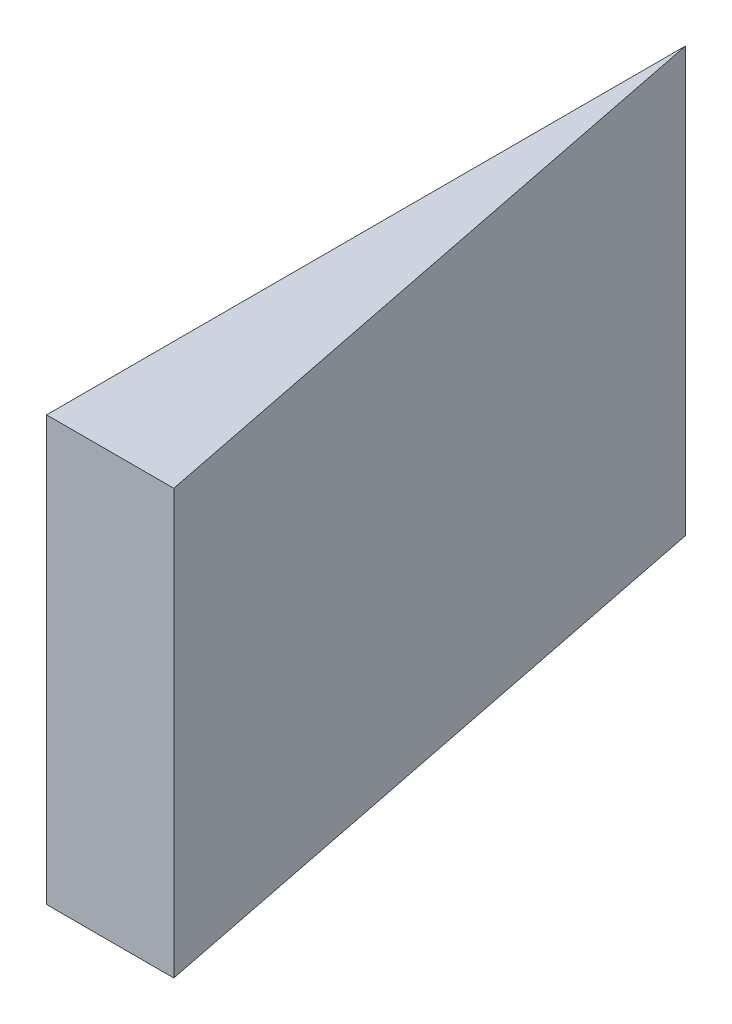
ISO-10303-21;
HEADER;
FILE_DESCRIPTION(('STEP AP214'),'2;1');
FILE_NAME('part.step','',(''),(''),'','','');
FILE_SCHEMA(('AUTOMOTIVE_DESIGN { 1 0 10303 214 1 1 1 1 }'));
ENDSEC;
DATA;
#1=APPLICATION_CONTEXT('core data for automotive mechanical design processes');
#2=APPLICATION_PROTOCOL_DEFINITION('international standard','automotive_design',2000,#1);
#3=PRODUCT_CONTEXT('',#1,'mechanical');
#4=PRODUCT('Part','Part','',(#3));
#5=PRODUCT_RELATED_PRODUCT_CATEGORY('part','',(#4));
#6=PRODUCT_DEFINITION_FORMATION('','',#4);
#7=PRODUCT_DEFINITION_CONTEXT('part definition',#1,'design');
#8=PRODUCT_DEFINITION('design','',#6,#7);
#9=PRODUCT_DEFINITION_SHAPE('','',#8);
#10=(LENGTH_UNIT() NAMED_UNIT(*) SI_UNIT(.MILLI.,.METRE.));
#11=(NAMED_UNIT(*) PLANE_ANGLE_UNIT() SI_UNIT($,.RADIAN.));
#12=(NAMED_UNIT(*) SI_UNIT($,.STERADIAN.) SOLID_ANGLE_UNIT());
#13=UNCERTAINTY_MEASURE_WITH_UNIT(LENGTH_MEASURE(1.E-05),#10,'distance_accuracy_value','');
#14=(GEOMETRIC_REPRESENTATION_CONTEXT(3) GLOBAL_UNCERTAINTY_ASSIGNED_CONTEXT((#13)) GLOBAL_UNIT_ASSIGNED_CONTEXT((#10,
#11,#12)) REPRESENTATION_CONTEXT('',''));
#15=CARTESIAN_POINT('',(0.,0.,0.));
#16=DIRECTION('',(0.,0.,1.));
#17=DIRECTION('',(1.,0.,0.));
#18=AXIS2_PLACEMENT_3D('',#15,#16,#17);
#19=CARTESIAN_POINT('',(3.37532157517583,-0.750000635465335,-5.23287741907118));
#20=DIRECTION('',(1.74845553146952E-07,1.,8.74227765734759E-08));
#21=DIRECTION('',(-1.,1.74845553146952E-07,0.));
#22=AXIS2_PLACEMENT_3D('',#19,#20,#21);
#23=PLANE('',#22);
#24=DIRECTION('',(-0.195310522456604,1.19888317361196E-07,-0.980741454114036));
#25=VECTOR('',#24,1.);
#26=CARTESIAN_POINT('',(3.2999998688658,-0.750000760577156,-3.65112158656318));
#27=LINE('',#26,#25);
#28=CARTESIAN_POINT('',(3.2999998688658,-0.750000760579156,-3.65112158656418));
#29=VERTEX_POINT('',#28);
#30=CARTESIAN_POINT('',(2.99999986886583,-0.750000576428836,-5.15755571276018));
#31=VERTEX_POINT('',#30);
#32=EDGE_CURVE('E11',#29,#31,#27,.T.);
#33=ORIENTED_EDGE('',*,*,#32,.T.);
#34=DIRECTION('',(0.,-8.74227765663743E-08,0.999999999999996));
#35=VECTOR('',#34,1.);
#36=CARTESIAN_POINT('',(2.99999986886583,-0.750000576426836,-5.15755571276118));
#37=LINE('',#36,#35);
#38=CARTESIAN_POINT('',(2.9999998688658,-0.75000070812549,-3.65112158656318));
#39=VERTEX_POINT('',#38);
#40=EDGE_CURVE('E49',#31,#39,#37,.T.);
#41=ORIENTED_EDGE('',*,*,#40,.T.);
#42=DIRECTION('',(0.999999999999985,-1.74845553220964E-07,0.));
#43=VECTOR('',#42,1.);
#44=CARTESIAN_POINT('',(2.9999998688658,-0.75000070812349,-3.65112158656318));
#45=LINE('',#44,#43);
#46=EDGE_CURVE('E47',#39,#29,#45,.T.);
#47=ORIENTED_EDGE('',*,*,#46,.T.);
#48=EDGE_LOOP('',(#33,#41,#47));
#49=FACE_BOUND('',#48,.T.);
#50=ADVANCED_FACE('F17',(#49),#23,.T.);
#51=CARTESIAN_POINT('',(3.37532140033027,-1.75000063546633,-5.23287750649395));
#52=DIRECTION('',(1.74845553146952E-07,1.,8.74227765734759E-08));
#53=DIRECTION('',(-1.,1.74845553146952E-07,0.));
#54=AXIS2_PLACEMENT_3D('',#51,#52,#53);
#55=PLANE('',#54);
#56=DIRECTION('',(0.999999999999985,-1.74845553591038E-07,0.));
#57=VECTOR('',#56,1.);
#58=CARTESIAN_POINT('',(2.99999969402025,-1.75000070812449,-3.65112167398595));
#59=LINE('',#58,#57);
#60=CARTESIAN_POINT('',(2.99999969402025,-1.75000070812349,-3.65112167398595));
#61=VERTEX_POINT('',#60);
#62=CARTESIAN_POINT('',(3.29999969402025,-1.75000076057716,-3.65112167398695));
#63=VERTEX_POINT('',#62);
#64=EDGE_CURVE('E24',#61,#63,#59,.T.);
#65=ORIENTED_EDGE('',*,*,#64,.F.);
#66=DIRECTION('',(0.,-8.74227765663743E-08,0.999999999999996));
#67=VECTOR('',#66,1.);
#68=CARTESIAN_POINT('',(2.99999969402027,-1.75000057642784,-5.15755580018395));
#69=LINE('',#68,#67);
#70=CARTESIAN_POINT('',(2.99999969402027,-1.75000057642684,-5.15755580018295));
#71=VERTEX_POINT('',#70);
#72=EDGE_CURVE('E53',#71,#61,#69,.T.);
#73=ORIENTED_EDGE('',*,*,#72,.F.);
#74=DIRECTION('',(-0.195310522456603,1.19888317433476E-07,-0.980741454114036));
#75=VECTOR('',#74,1.);
#76=CARTESIAN_POINT('',(3.29999969402025,-1.75000076057816,-3.65112167398595));
#77=LINE('',#76,#75);
#78=EDGE_CURVE('E68',#63,#71,#77,.T.);
#79=ORIENTED_EDGE('',*,*,#78,.F.);
#80=EDGE_LOOP('',(#65,#73,#79));
#81=FACE_BOUND('',#80,.T.);
#82=ADVANCED_FACE('F73',(#81),#55,.F.);
#83=CARTESIAN_POINT('',(3.2999998688658,-0.750000760577156,-3.65112158656318));
#84=DIRECTION('',(-0.980741454114044,1.54403693849392E-07,0.195310522456619));
#85=DIRECTION('',(-0.195310522456604,1.19888317353705E-07,-0.980741454114041));
#86=AXIS2_PLACEMENT_3D('',#83,#84,#85);
#87=PLANE('',#86);
#88=DIRECTION('',(-1.74845553146774E-07,-0.999999999999981,-8.74227765733868E-08));
#89=VECTOR('',#88,1.);
#90=CARTESIAN_POINT('',(3.2999998688658,-0.750000760577156,-3.65112158656318));
#91=LINE('',#90,#89);
#92=EDGE_CURVE('E59',#29,#63,#91,.T.);
#93=ORIENTED_EDGE('',*,*,#92,.T.);
#94=ORIENTED_EDGE('',*,*,#78,.T.);
#95=DIRECTION('',(-1.74845553146774E-07,-0.999999999999981,-8.74227765733868E-08));
#96=VECTOR('',#95,1.);
#97=CARTESIAN_POINT('',(2.99999986886583,-0.750000576426836,-5.15755571276118));
#98=LINE('',#97,#96);
#99=EDGE_CURVE('E54',#31,#71,#98,.T.);
#100=ORIENTED_EDGE('',*,*,#99,.F.);
#101=ORIENTED_EDGE('',*,*,#32,.F.);
#102=EDGE_LOOP('',(#93,#94,#100,#101));
#103=FACE_BOUND('',#102,.T.);
#104=ADVANCED_FACE('F57',(#103),#87,.F.);
#105=CARTESIAN_POINT('',(2.99999986886583,-0.750000576426836,-5.15755571276118));
#106=DIRECTION('',(1.,-1.74845553146952E-07,0.));
#107=DIRECTION('',(0.,-8.74227765734759E-08,1.));
#108=AXIS2_PLACEMENT_3D('',#105,#106,#107);
#109=PLANE('',#108);
#110=ORIENTED_EDGE('',*,*,#99,.T.);
#111=ORIENTED_EDGE('',*,*,#72,.T.);
#112=DIRECTION('',(-1.74845553146774E-07,-0.999999999999981,-8.74227765733868E-08));
#113=VECTOR('',#112,1.);
#114=CARTESIAN_POINT('',(2.9999998688658,-0.75000070812349,-3.65112158656318));
#115=LINE('',#114,#113);
#116=EDGE_CURVE('E70',#39,#61,#115,.T.);
#117=ORIENTED_EDGE('',*,*,#116,.F.);
#118=ORIENTED_EDGE('',*,*,#40,.F.);
#119=EDGE_LOOP('',(#110,#111,#117,#118));
#120=FACE_BOUND('',#119,.T.);
#121=ADVANCED_FACE('F72',(#120),#109,.F.);
#122=CARTESIAN_POINT('',(2.9999998688658,-0.75000070812349,-3.65112158656318));
#123=DIRECTION('',(0.,8.74227765734759E-08,-1.));
#124=DIRECTION('',(1.,-1.74845553146952E-07,0.));
#125=AXIS2_PLACEMENT_3D('',#122,#123,#124);
#126=PLANE('',#125);
#127=ORIENTED_EDGE('',*,*,#116,.T.);
#128=ORIENTED_EDGE('',*,*,#64,.T.);
#129=ORIENTED_EDGE('',*,*,#92,.F.);
#130=ORIENTED_EDGE('',*,*,#46,.F.);
#131=EDGE_LOOP('',(#127,#128,#129,#130));
#132=FACE_BOUND('',#131,.T.);
#133=ADVANCED_FACE('F61',(#132),#126,.F.);
#134=CLOSED_SHELL('',(#50,#82,#104,#121,#133));
#135=MANIFOLD_SOLID_BREP('B1',#134);
#136=ADVANCED_BREP_SHAPE_REPRESENTATION('',(#18,#135),#14);
#137=SHAPE_DEFINITION_REPRESENTATION(#9,#136);
ENDSEC;
END-ISO-10303-21;
